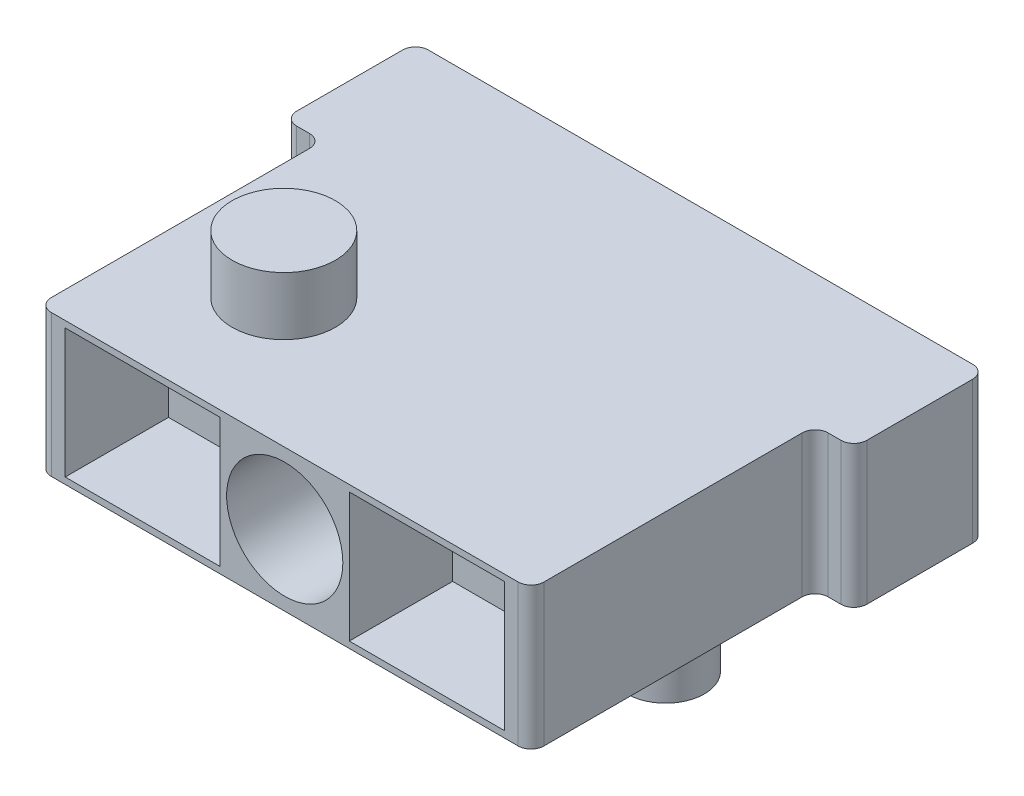
ISO-10303-21;
HEADER;
FILE_DESCRIPTION(('STEP AP214'),'2;1');
FILE_NAME('part.step','',(''),(''),'','','');
FILE_SCHEMA(('AUTOMOTIVE_DESIGN { 1 0 10303 214 1 1 1 1 }'));
ENDSEC;
DATA;
#1=APPLICATION_CONTEXT('core data for automotive mechanical design processes');
#2=APPLICATION_PROTOCOL_DEFINITION('international standard','automotive_design',2000,#1);
#3=PRODUCT_CONTEXT('',#1,'mechanical');
#4=PRODUCT('Part','Part','',(#3));
#5=PRODUCT_RELATED_PRODUCT_CATEGORY('part','',(#4));
#6=PRODUCT_DEFINITION_FORMATION('','',#4);
#7=PRODUCT_DEFINITION_CONTEXT('part definition',#1,'design');
#8=PRODUCT_DEFINITION('design','',#6,#7);
#9=PRODUCT_DEFINITION_SHAPE('','',#8);
#10=(LENGTH_UNIT() NAMED_UNIT(*) SI_UNIT(.MILLI.,.METRE.));
#11=(NAMED_UNIT(*) PLANE_ANGLE_UNIT() SI_UNIT($,.RADIAN.));
#12=(NAMED_UNIT(*) SI_UNIT($,.STERADIAN.) SOLID_ANGLE_UNIT());
#13=UNCERTAINTY_MEASURE_WITH_UNIT(LENGTH_MEASURE(1.E-05),#10,'distance_accuracy_value','');
#14=(GEOMETRIC_REPRESENTATION_CONTEXT(3) GLOBAL_UNCERTAINTY_ASSIGNED_CONTEXT((#13)) GLOBAL_UNIT_ASSIGNED_CONTEXT((#10,
#11,#12)) REPRESENTATION_CONTEXT('',''));
#15=CARTESIAN_POINT('',(0.,0.,0.));
#16=DIRECTION('',(0.,0.,1.));
#17=DIRECTION('',(1.,0.,0.));
#18=AXIS2_PLACEMENT_3D('',#15,#16,#17);
#19=CARTESIAN_POINT('',(22.075,-5.5,-32.2));
#20=DIRECTION('',(1.,0.,0.));
#21=DIRECTION('',(0.,0.,-1.));
#22=AXIS2_PLACEMENT_3D('',#19,#20,#21);
#23=PLANE('',#22);
#24=DIRECTION('',(0.,0.,1.));
#25=VECTOR('',#24,1.);
#26=CARTESIAN_POINT('',(22.075,-5.5,-32.2));
#27=LINE('',#26,#25);
#28=CARTESIAN_POINT('',(22.075,-5.5,-31.2));
#29=VERTEX_POINT('',#28);
#30=CARTESIAN_POINT('',(22.075,-5.5,-23.));
#31=VERTEX_POINT('',#30);
#32=EDGE_CURVE('E345',#29,#31,#27,.T.);
#33=ORIENTED_EDGE('',*,*,#32,.F.);
#34=DIRECTION('',(0.,1.,0.));
#35=VECTOR('',#34,1.);
#36=CARTESIAN_POINT('',(22.075,-5.5,-31.2));
#37=LINE('',#36,#35);
#38=CARTESIAN_POINT('',(22.075,5.5,-31.2));
#39=VERTEX_POINT('',#38);
#40=EDGE_CURVE('E405',#29,#39,#37,.T.);
#41=ORIENTED_EDGE('',*,*,#40,.T.);
#42=DIRECTION('',(0.,0.,1.));
#43=VECTOR('',#42,1.);
#44=CARTESIAN_POINT('',(22.075,5.5,-32.2));
#45=LINE('',#44,#43);
#46=CARTESIAN_POINT('',(22.075,5.5,-23.));
#47=VERTEX_POINT('',#46);
#48=EDGE_CURVE('E340',#39,#47,#45,.T.);
#49=ORIENTED_EDGE('',*,*,#48,.T.);
#50=DIRECTION('',(0.,1.,0.));
#51=VECTOR('',#50,1.);
#52=CARTESIAN_POINT('',(22.075,-5.5,-23.));
#53=LINE('',#52,#51);
#54=EDGE_CURVE('E403',#47,#31,#53,.F.);
#55=ORIENTED_EDGE('',*,*,#54,.T.);
#56=EDGE_LOOP('',(#33,#41,#49,#55));
#57=FACE_BOUND('',#56,.T.);
#58=ADVANCED_FACE('F35',(#57),#23,.T.);
#59=CARTESIAN_POINT('',(-22.075,-5.5,-32.2));
#60=DIRECTION('',(0.,-1.,0.));
#61=DIRECTION('',(0.,0.,-1.));
#62=AXIS2_PLACEMENT_3D('',#59,#60,#61);
#63=PLANE('',#62);
#64=DIRECTION('',(0.,0.,-1.));
#65=VECTOR('',#64,1.);
#66=CARTESIAN_POINT('',(19.075,-5.5,-32.2));
#67=LINE('',#66,#65);
#68=CARTESIAN_POINT('',(19.075,-5.5,-1.));
#69=VERTEX_POINT('',#68);
#70=CARTESIAN_POINT('',(19.075,-5.5,-21.));
#71=VERTEX_POINT('',#70);
#72=EDGE_CURVE('E287',#69,#71,#67,.T.);
#73=ORIENTED_EDGE('',*,*,#72,.F.);
#74=CARTESIAN_POINT('',(18.075,-5.5,-1.));
#75=DIRECTION('',(0.,-1.,0.));
#76=DIRECTION('',(0.,0.,-1.));
#77=AXIS2_PLACEMENT_3D('',#74,#75,#76);
#78=CIRCLE('',#77,1.);
#79=CARTESIAN_POINT('',(18.075,-5.5,0.));
#80=VERTEX_POINT('',#79);
#81=EDGE_CURVE('E388',#69,#80,#78,.T.);
#82=ORIENTED_EDGE('',*,*,#81,.T.);
#83=DIRECTION('',(1.,0.,0.));
#84=VECTOR('',#83,1.);
#85=CARTESIAN_POINT('',(-22.075,-5.5,0.));
#86=LINE('',#85,#84);
#87=CARTESIAN_POINT('',(-18.075,-5.5,0.));
#88=VERTEX_POINT('',#87);
#89=EDGE_CURVE('E337',#88,#80,#86,.T.);
#90=ORIENTED_EDGE('',*,*,#89,.F.);
#91=CARTESIAN_POINT('',(-18.075,-5.5,-1.));
#92=DIRECTION('',(0.,-1.,0.));
#93=DIRECTION('',(0.,0.,-1.));
#94=AXIS2_PLACEMENT_3D('',#91,#92,#93);
#95=CIRCLE('',#94,1.);
#96=CARTESIAN_POINT('',(-19.075,-5.5,-1.));
#97=VERTEX_POINT('',#96);
#98=EDGE_CURVE('E50',#88,#97,#95,.T.);
#99=ORIENTED_EDGE('',*,*,#98,.T.);
#100=DIRECTION('',(0.,0.,1.));
#101=VECTOR('',#100,1.);
#102=CARTESIAN_POINT('',(-19.075,-5.5,-32.2));
#103=LINE('',#102,#101);
#104=CARTESIAN_POINT('',(-19.075,-5.5,-21.));
#105=VERTEX_POINT('',#104);
#106=EDGE_CURVE('E294',#105,#97,#103,.T.);
#107=ORIENTED_EDGE('',*,*,#106,.F.);
#108=CARTESIAN_POINT('',(-20.075,-5.5,-21.));
#109=DIRECTION('',(0.,-1.,0.));
#110=DIRECTION('',(0.,0.,-1.));
#111=AXIS2_PLACEMENT_3D('',#108,#109,#110);
#112=CIRCLE('',#111,1.);
#113=CARTESIAN_POINT('',(-20.075,-5.5,-22.));
#114=VERTEX_POINT('',#113);
#115=EDGE_CURVE('E420',#105,#114,#112,.F.);
#116=ORIENTED_EDGE('',*,*,#115,.T.);
#117=DIRECTION('',(1.,0.,0.));
#118=VECTOR('',#117,1.);
#119=CARTESIAN_POINT('',(-22.075,-5.5,-22.));
#120=LINE('',#119,#118);
#121=CARTESIAN_POINT('',(-21.075,-5.5,-22.));
#122=VERTEX_POINT('',#121);
#123=EDGE_CURVE('E299',#122,#114,#120,.T.);
#124=ORIENTED_EDGE('',*,*,#123,.F.);
#125=CARTESIAN_POINT('',(-21.075,-5.5,-23.));
#126=DIRECTION('',(0.,-1.,0.));
#127=DIRECTION('',(0.,0.,-1.));
#128=AXIS2_PLACEMENT_3D('',#125,#126,#127);
#129=CIRCLE('',#128,1.);
#130=CARTESIAN_POINT('',(-22.075,-5.5,-23.));
#131=VERTEX_POINT('',#130);
#132=EDGE_CURVE('E381',#122,#131,#129,.T.);
#133=ORIENTED_EDGE('',*,*,#132,.T.);
#134=DIRECTION('',(0.,0.,1.));
#135=VECTOR('',#134,1.);
#136=CARTESIAN_POINT('',(-22.075,-5.5,-32.2));
#137=LINE('',#136,#135);
#138=CARTESIAN_POINT('',(-22.075,-5.5,-31.2));
#139=VERTEX_POINT('',#138);
#140=EDGE_CURVE('E349',#139,#131,#137,.T.);
#141=ORIENTED_EDGE('',*,*,#140,.F.);
#142=CARTESIAN_POINT('',(-21.075,-5.5,-31.2));
#143=DIRECTION('',(0.,-1.,0.));
#144=DIRECTION('',(0.,0.,-1.));
#145=AXIS2_PLACEMENT_3D('',#142,#143,#144);
#146=CIRCLE('',#145,1.);
#147=CARTESIAN_POINT('',(-21.075,-5.5,-32.2));
#148=VERTEX_POINT('',#147);
#149=EDGE_CURVE('E383',#139,#148,#146,.T.);
#150=ORIENTED_EDGE('',*,*,#149,.T.);
#151=DIRECTION('',(1.,0.,0.));
#152=VECTOR('',#151,1.);
#153=CARTESIAN_POINT('',(-22.075,-5.5,-32.2));
#154=LINE('',#153,#152);
#155=CARTESIAN_POINT('',(21.075,-5.5,-32.2));
#156=VERTEX_POINT('',#155);
#157=EDGE_CURVE('E336',#148,#156,#154,.T.);
#158=ORIENTED_EDGE('',*,*,#157,.T.);
#159=CARTESIAN_POINT('',(21.075,-5.5,-31.2));
#160=DIRECTION('',(0.,-1.,0.));
#161=DIRECTION('',(0.,0.,-1.));
#162=AXIS2_PLACEMENT_3D('',#159,#160,#161);
#163=CIRCLE('',#162,1.);
#164=EDGE_CURVE('E385',#156,#29,#163,.T.);
#165=ORIENTED_EDGE('',*,*,#164,.T.);
#166=ORIENTED_EDGE('',*,*,#32,.T.);
#167=CARTESIAN_POINT('',(21.075,-5.5,-23.));
#168=DIRECTION('',(0.,-1.,0.));
#169=DIRECTION('',(0.,0.,-1.));
#170=AXIS2_PLACEMENT_3D('',#167,#168,#169);
#171=CIRCLE('',#170,1.);
#172=CARTESIAN_POINT('',(21.075,-5.5,-22.));
#173=VERTEX_POINT('',#172);
#174=EDGE_CURVE('E379',#31,#173,#171,.T.);
#175=ORIENTED_EDGE('',*,*,#174,.T.);
#176=DIRECTION('',(1.,0.,0.));
#177=VECTOR('',#176,1.);
#178=CARTESIAN_POINT('',(-22.075,-5.5,-22.));
#179=LINE('',#178,#177);
#180=CARTESIAN_POINT('',(20.075,-5.5,-22.));
#181=VERTEX_POINT('',#180);
#182=EDGE_CURVE('E296',#181,#173,#179,.T.);
#183=ORIENTED_EDGE('',*,*,#182,.F.);
#184=CARTESIAN_POINT('',(20.075,-5.5,-21.));
#185=DIRECTION('',(0.,-1.,0.));
#186=DIRECTION('',(0.,0.,-1.));
#187=AXIS2_PLACEMENT_3D('',#184,#185,#186);
#188=CIRCLE('',#187,1.);
#189=EDGE_CURVE('E11',#181,#71,#188,.F.);
#190=ORIENTED_EDGE('',*,*,#189,.T.);
#191=EDGE_LOOP('',(#73,#82,#90,#99,#107,#116,#124,#133,#141,#150,#158,#165,#166,#175,#183,#190));
#192=FACE_BOUND('',#191,.T.);
#193=CARTESIAN_POINT('',(14.3,-5.5,-15.2));
#194=DIRECTION('',(0.,-1.,0.));
#195=DIRECTION('',(0.,0.,-1.));
#196=AXIS2_PLACEMENT_3D('',#193,#194,#195);
#197=CIRCLE('',#196,3.);
#198=CARTESIAN_POINT('',(14.3,-5.5,-18.2));
#199=VERTEX_POINT('',#198);
#200=EDGE_CURVE('E320',#199,#199,#197,.T.);
#201=ORIENTED_EDGE('',*,*,#200,.F.);
#202=EDGE_LOOP('',(#201));
#203=FACE_BOUND('',#202,.T.);
#204=CARTESIAN_POINT('',(-14.3,-5.5,-15.2));
#205=DIRECTION('',(0.,-1.,0.));
#206=DIRECTION('',(0.,0.,-1.));
#207=AXIS2_PLACEMENT_3D('',#204,#205,#206);
#208=CIRCLE('',#207,3.);
#209=CARTESIAN_POINT('',(-14.3,-5.5,-18.2));
#210=VERTEX_POINT('',#209);
#211=EDGE_CURVE('E324',#210,#210,#208,.T.);
#212=ORIENTED_EDGE('',*,*,#211,.F.);
#213=EDGE_LOOP('',(#212));
#214=FACE_BOUND('',#213,.T.);
#215=ADVANCED_FACE('F437',(#192,#203,#214),#63,.T.);
#216=CARTESIAN_POINT('',(-22.075,-5.5,-32.2));
#217=DIRECTION('',(-1.,0.,0.));
#218=DIRECTION('',(0.,0.,1.));
#219=AXIS2_PLACEMENT_3D('',#216,#217,#218);
#220=PLANE('',#219);
#221=DIRECTION('',(0.,0.,1.));
#222=VECTOR('',#221,1.);
#223=CARTESIAN_POINT('',(-22.075,5.5,-32.2));
#224=LINE('',#223,#222);
#225=CARTESIAN_POINT('',(-22.075,5.5,-31.2));
#226=VERTEX_POINT('',#225);
#227=CARTESIAN_POINT('',(-22.075,5.5,-23.));
#228=VERTEX_POINT('',#227);
#229=EDGE_CURVE('E352',#226,#228,#224,.T.);
#230=ORIENTED_EDGE('',*,*,#229,.F.);
#231=DIRECTION('',(0.,-1.,0.));
#232=VECTOR('',#231,1.);
#233=CARTESIAN_POINT('',(-22.075,-5.5,-31.2));
#234=LINE('',#233,#232);
#235=EDGE_CURVE('E415',#226,#139,#234,.T.);
#236=ORIENTED_EDGE('',*,*,#235,.T.);
#237=ORIENTED_EDGE('',*,*,#140,.T.);
#238=DIRECTION('',(0.,1.,0.));
#239=VECTOR('',#238,1.);
#240=CARTESIAN_POINT('',(-22.075,5.5,-23.));
#241=LINE('',#240,#239);
#242=EDGE_CURVE('E412',#131,#228,#241,.T.);
#243=ORIENTED_EDGE('',*,*,#242,.T.);
#244=EDGE_LOOP('',(#230,#236,#237,#243));
#245=FACE_BOUND('',#244,.T.);
#246=ADVANCED_FACE('F471',(#245),#220,.T.);
#247=CARTESIAN_POINT('',(-22.075,5.5,-32.2));
#248=DIRECTION('',(0.,1.,0.));
#249=DIRECTION('',(0.,0.,1.));
#250=AXIS2_PLACEMENT_3D('',#247,#248,#249);
#251=PLANE('',#250);
#252=DIRECTION('',(-1.,0.,0.));
#253=VECTOR('',#252,1.);
#254=CARTESIAN_POINT('',(-22.075,5.5,0.));
#255=LINE('',#254,#253);
#256=CARTESIAN_POINT('',(18.075,5.5,0.));
#257=VERTEX_POINT('',#256);
#258=CARTESIAN_POINT('',(-18.075,5.5,0.));
#259=VERTEX_POINT('',#258);
#260=EDGE_CURVE('E330',#257,#259,#255,.T.);
#261=ORIENTED_EDGE('',*,*,#260,.F.);
#262=CARTESIAN_POINT('',(18.075,5.5,-1.));
#263=DIRECTION('',(0.,1.,0.));
#264=DIRECTION('',(0.,0.,1.));
#265=AXIS2_PLACEMENT_3D('',#262,#263,#264);
#266=CIRCLE('',#265,1.);
#267=CARTESIAN_POINT('',(19.075,5.5,-1.));
#268=VERTEX_POINT('',#267);
#269=EDGE_CURVE('E372',#257,#268,#266,.T.);
#270=ORIENTED_EDGE('',*,*,#269,.T.);
#271=DIRECTION('',(0.,0.,1.));
#272=VECTOR('',#271,1.);
#273=CARTESIAN_POINT('',(19.075,5.5,0.));
#274=LINE('',#273,#272);
#275=CARTESIAN_POINT('',(19.075,5.5,-21.));
#276=VERTEX_POINT('',#275);
#277=EDGE_CURVE('E284',#276,#268,#274,.T.);
#278=ORIENTED_EDGE('',*,*,#277,.F.);
#279=CARTESIAN_POINT('',(20.075,5.5,-21.));
#280=DIRECTION('',(0.,1.,0.));
#281=DIRECTION('',(0.,0.,1.));
#282=AXIS2_PLACEMENT_3D('',#279,#280,#281);
#283=CIRCLE('',#282,1.);
#284=CARTESIAN_POINT('',(20.075,5.5,-22.));
#285=VERTEX_POINT('',#284);
#286=EDGE_CURVE('E43',#276,#285,#283,.F.);
#287=ORIENTED_EDGE('',*,*,#286,.T.);
#288=DIRECTION('',(-1.,0.,0.));
#289=VECTOR('',#288,1.);
#290=CARTESIAN_POINT('',(22.075,5.5,-22.));
#291=LINE('',#290,#289);
#292=CARTESIAN_POINT('',(21.075,5.5,-22.));
#293=VERTEX_POINT('',#292);
#294=EDGE_CURVE('E245',#293,#285,#291,.T.);
#295=ORIENTED_EDGE('',*,*,#294,.F.);
#296=CARTESIAN_POINT('',(21.075,5.5,-23.));
#297=DIRECTION('',(0.,1.,0.));
#298=DIRECTION('',(0.,0.,1.));
#299=AXIS2_PLACEMENT_3D('',#296,#297,#298);
#300=CIRCLE('',#299,1.);
#301=EDGE_CURVE('E362',#293,#47,#300,.T.);
#302=ORIENTED_EDGE('',*,*,#301,.T.);
#303=ORIENTED_EDGE('',*,*,#48,.F.);
#304=CARTESIAN_POINT('',(21.075,5.5,-31.2));
#305=DIRECTION('',(0.,1.,0.));
#306=DIRECTION('',(0.,0.,1.));
#307=AXIS2_PLACEMENT_3D('',#304,#305,#306);
#308=CIRCLE('',#307,1.);
#309=CARTESIAN_POINT('',(21.075,5.5,-32.2));
#310=VERTEX_POINT('',#309);
#311=EDGE_CURVE('E368',#39,#310,#308,.T.);
#312=ORIENTED_EDGE('',*,*,#311,.T.);
#313=DIRECTION('',(-1.,0.,0.));
#314=VECTOR('',#313,1.);
#315=CARTESIAN_POINT('',(-22.075,5.5,-32.2));
#316=LINE('',#315,#314);
#317=CARTESIAN_POINT('',(-21.075,5.5,-32.2));
#318=VERTEX_POINT('',#317);
#319=EDGE_CURVE('E333',#310,#318,#316,.T.);
#320=ORIENTED_EDGE('',*,*,#319,.T.);
#321=CARTESIAN_POINT('',(-21.075,5.5,-31.2));
#322=DIRECTION('',(0.,1.,0.));
#323=DIRECTION('',(0.,0.,1.));
#324=AXIS2_PLACEMENT_3D('',#321,#322,#323);
#325=CIRCLE('',#324,1.);
#326=EDGE_CURVE('E366',#318,#226,#325,.T.);
#327=ORIENTED_EDGE('',*,*,#326,.T.);
#328=ORIENTED_EDGE('',*,*,#229,.T.);
#329=CARTESIAN_POINT('',(-21.075,5.5,-23.));
#330=DIRECTION('',(0.,1.,0.));
#331=DIRECTION('',(0.,0.,1.));
#332=AXIS2_PLACEMENT_3D('',#329,#330,#331);
#333=CIRCLE('',#332,1.);
#334=CARTESIAN_POINT('',(-21.075,5.5,-22.));
#335=VERTEX_POINT('',#334);
#336=EDGE_CURVE('E364',#228,#335,#333,.T.);
#337=ORIENTED_EDGE('',*,*,#336,.T.);
#338=DIRECTION('',(-1.,0.,0.));
#339=VECTOR('',#338,1.);
#340=CARTESIAN_POINT('',(-22.075,5.5,-22.));
#341=LINE('',#340,#339);
#342=CARTESIAN_POINT('',(-20.075,5.5,-22.));
#343=VERTEX_POINT('',#342);
#344=EDGE_CURVE('E283',#343,#335,#341,.T.);
#345=ORIENTED_EDGE('',*,*,#344,.F.);
#346=CARTESIAN_POINT('',(-20.075,5.5,-21.));
#347=DIRECTION('',(0.,1.,0.));
#348=DIRECTION('',(0.,0.,1.));
#349=AXIS2_PLACEMENT_3D('',#346,#347,#348);
#350=CIRCLE('',#349,1.);
#351=CARTESIAN_POINT('',(-19.075,5.5,-21.));
#352=VERTEX_POINT('',#351);
#353=EDGE_CURVE('E418',#343,#352,#350,.F.);
#354=ORIENTED_EDGE('',*,*,#353,.T.);
#355=DIRECTION('',(0.,0.,-1.));
#356=VECTOR('',#355,1.);
#357=CARTESIAN_POINT('',(-19.075,5.5,0.));
#358=LINE('',#357,#356);
#359=CARTESIAN_POINT('',(-19.075,5.5,-1.));
#360=VERTEX_POINT('',#359);
#361=EDGE_CURVE('E281',#360,#352,#358,.T.);
#362=ORIENTED_EDGE('',*,*,#361,.F.);
#363=CARTESIAN_POINT('',(-18.075,5.5,-1.));
#364=DIRECTION('',(0.,1.,0.));
#365=DIRECTION('',(0.,0.,1.));
#366=AXIS2_PLACEMENT_3D('',#363,#364,#365);
#367=CIRCLE('',#366,1.);
#368=EDGE_CURVE('E370',#360,#259,#367,.T.);
#369=ORIENTED_EDGE('',*,*,#368,.T.);
#370=EDGE_LOOP('',(#261,#270,#278,#287,#295,#302,#303,#312,#320,#327,#328,#337,#345,#354,#362,#369));
#371=FACE_BOUND('',#370,.T.);
#372=CARTESIAN_POINT('',(-10.075,5.5,-10.));
#373=DIRECTION('',(0.,1.,0.));
#374=DIRECTION('',(0.,0.,1.));
#375=AXIS2_PLACEMENT_3D('',#372,#373,#374);
#376=CIRCLE('',#375,4.);
#377=CARTESIAN_POINT('',(-10.075,5.5,-6.));
#378=VERTEX_POINT('',#377);
#379=EDGE_CURVE('E302',#378,#378,#376,.T.);
#380=ORIENTED_EDGE('',*,*,#379,.F.);
#381=EDGE_LOOP('',(#380));
#382=FACE_BOUND('',#381,.T.);
#383=ADVANCED_FACE('F425',(#371,#382),#251,.T.);
#384=CARTESIAN_POINT('',(0.,0.,-32.2));
#385=DIRECTION('',(0.,0.,-1.));
#386=DIRECTION('',(-1.,0.,0.));
#387=AXIS2_PLACEMENT_3D('',#384,#385,#386);
#388=PLANE('',#387);
#389=ORIENTED_EDGE('',*,*,#319,.F.);
#390=DIRECTION('',(0.,1.,0.));
#391=VECTOR('',#390,1.);
#392=CARTESIAN_POINT('',(21.075,0.,-32.2));
#393=LINE('',#392,#391);
#394=EDGE_CURVE('E410',#310,#156,#393,.F.);
#395=ORIENTED_EDGE('',*,*,#394,.T.);
#396=ORIENTED_EDGE('',*,*,#157,.F.);
#397=DIRECTION('',(0.,-1.,0.));
#398=VECTOR('',#397,1.);
#399=CARTESIAN_POINT('',(-21.075,0.,-32.2));
#400=LINE('',#399,#398);
#401=EDGE_CURVE('E408',#148,#318,#400,.F.);
#402=ORIENTED_EDGE('',*,*,#401,.T.);
#403=EDGE_LOOP('',(#389,#395,#396,#402));
#404=FACE_BOUND('',#403,.T.);
#405=ADVANCED_FACE('F481',(#404),#388,.T.);
#406=CARTESIAN_POINT('',(0.,0.,0.));
#407=DIRECTION('',(0.,0.,-1.));
#408=DIRECTION('',(-1.,0.,0.));
#409=AXIS2_PLACEMENT_3D('',#406,#407,#408);
#410=PLANE('',#409);
#411=CARTESIAN_POINT('',(0.,0.,0.));
#412=DIRECTION('',(0.,0.,1.));
#413=DIRECTION('',(1.,0.,0.));
#414=AXIS2_PLACEMENT_3D('',#411,#412,#413);
#415=CIRCLE('',#414,4.5);
#416=CARTESIAN_POINT('',(4.5,0.,0.));
#417=VERTEX_POINT('',#416);
#418=EDGE_CURVE('E232',#417,#417,#415,.T.);
#419=ORIENTED_EDGE('',*,*,#418,.F.);
#420=EDGE_LOOP('',(#419));
#421=FACE_BOUND('',#420,.T.);
#422=DIRECTION('',(1.,0.,0.));
#423=VECTOR('',#422,1.);
#424=CARTESIAN_POINT('',(-17.,-5.,0.));
#425=LINE('',#424,#423);
#426=CARTESIAN_POINT('',(-17.,-5.,0.));
#427=VERTEX_POINT('',#426);
#428=CARTESIAN_POINT('',(-5.,-5.,0.));
#429=VERTEX_POINT('',#428);
#430=EDGE_CURVE('E238',#427,#429,#425,.T.);
#431=ORIENTED_EDGE('',*,*,#430,.F.);
#432=DIRECTION('',(0.,-1.,0.));
#433=VECTOR('',#432,1.);
#434=CARTESIAN_POINT('',(-17.,5.,0.));
#435=LINE('',#434,#433);
#436=CARTESIAN_POINT('',(-17.,5.,0.));
#437=VERTEX_POINT('',#436);
#438=EDGE_CURVE('E209',#437,#427,#435,.T.);
#439=ORIENTED_EDGE('',*,*,#438,.F.);
#440=DIRECTION('',(-1.,0.,0.));
#441=VECTOR('',#440,1.);
#442=CARTESIAN_POINT('',(-17.,5.,0.));
#443=LINE('',#442,#441);
#444=CARTESIAN_POINT('',(-5.,5.,0.));
#445=VERTEX_POINT('',#444);
#446=EDGE_CURVE('E226',#445,#437,#443,.T.);
#447=ORIENTED_EDGE('',*,*,#446,.F.);
#448=DIRECTION('',(0.,1.,0.));
#449=VECTOR('',#448,1.);
#450=CARTESIAN_POINT('',(-5.,5.,0.));
#451=LINE('',#450,#449);
#452=EDGE_CURVE('E229',#429,#445,#451,.T.);
#453=ORIENTED_EDGE('',*,*,#452,.F.);
#454=EDGE_LOOP('',(#431,#439,#447,#453));
#455=FACE_BOUND('',#454,.T.);
#456=DIRECTION('',(1.,0.,0.));
#457=VECTOR('',#456,1.);
#458=CARTESIAN_POINT('',(5.,-5.,0.));
#459=LINE('',#458,#457);
#460=CARTESIAN_POINT('',(5.,-5.,0.));
#461=VERTEX_POINT('',#460);
#462=CARTESIAN_POINT('',(17.,-5.,0.));
#463=VERTEX_POINT('',#462);
#464=EDGE_CURVE('E265',#461,#463,#459,.T.);
#465=ORIENTED_EDGE('',*,*,#464,.F.);
#466=DIRECTION('',(0.,-1.,0.));
#467=VECTOR('',#466,1.);
#468=CARTESIAN_POINT('',(5.,5.,0.));
#469=LINE('',#468,#467);
#470=CARTESIAN_POINT('',(5.,5.,0.));
#471=VERTEX_POINT('',#470);
#472=EDGE_CURVE('E263',#471,#461,#469,.T.);
#473=ORIENTED_EDGE('',*,*,#472,.F.);
#474=DIRECTION('',(-1.,0.,0.));
#475=VECTOR('',#474,1.);
#476=CARTESIAN_POINT('',(5.,5.,0.));
#477=LINE('',#476,#475);
#478=CARTESIAN_POINT('',(17.,5.,0.));
#479=VERTEX_POINT('',#478);
#480=EDGE_CURVE('E253',#479,#471,#477,.T.);
#481=ORIENTED_EDGE('',*,*,#480,.F.);
#482=DIRECTION('',(0.,1.,0.));
#483=VECTOR('',#482,1.);
#484=CARTESIAN_POINT('',(17.,5.,0.));
#485=LINE('',#484,#483);
#486=EDGE_CURVE('E269',#463,#479,#485,.T.);
#487=ORIENTED_EDGE('',*,*,#486,.F.);
#488=EDGE_LOOP('',(#465,#473,#481,#487));
#489=FACE_BOUND('',#488,.T.);
#490=ORIENTED_EDGE('',*,*,#89,.T.);
#491=DIRECTION('',(0.,1.,0.));
#492=VECTOR('',#491,1.);
#493=CARTESIAN_POINT('',(18.075,0.,0.));
#494=LINE('',#493,#492);
#495=EDGE_CURVE('E359',#80,#257,#494,.T.);
#496=ORIENTED_EDGE('',*,*,#495,.T.);
#497=ORIENTED_EDGE('',*,*,#260,.T.);
#498=DIRECTION('',(0.,-1.,0.));
#499=VECTOR('',#498,1.);
#500=CARTESIAN_POINT('',(-18.075,0.,0.));
#501=LINE('',#500,#499);
#502=EDGE_CURVE('E348',#259,#88,#501,.T.);
#503=ORIENTED_EDGE('',*,*,#502,.T.);
#504=EDGE_LOOP('',(#490,#496,#497,#503));
#505=FACE_BOUND('',#504,.T.);
#506=ADVANCED_FACE('F447',(#421,#455,#489,#505),#410,.F.);
#507=CARTESIAN_POINT('',(-14.3,-10.,-15.2));
#508=DIRECTION('',(0.,1.,0.));
#509=DIRECTION('',(0.,0.,1.));
#510=AXIS2_PLACEMENT_3D('',#507,#508,#509);
#511=CYLINDRICAL_SURFACE('',#510,3.);
#512=CARTESIAN_POINT('',(-14.3,-10.,-15.2));
#513=DIRECTION('',(0.,-1.,0.));
#514=DIRECTION('',(0.,0.,-1.));
#515=AXIS2_PLACEMENT_3D('',#512,#513,#514);
#516=CIRCLE('',#515,3.);
#517=CARTESIAN_POINT('',(-14.3,-10.,-18.2));
#518=VERTEX_POINT('',#517);
#519=EDGE_CURVE('E327',#518,#518,#516,.T.);
#520=ORIENTED_EDGE('',*,*,#519,.F.);
#521=EDGE_LOOP('',(#520));
#522=FACE_BOUND('',#521,.T.);
#523=ORIENTED_EDGE('',*,*,#211,.T.);
#524=EDGE_LOOP('',(#523));
#525=FACE_BOUND('',#524,.T.);
#526=ADVANCED_FACE('F770',(#522,#525),#511,.T.);
#527=CARTESIAN_POINT('',(-14.3,-10.,-15.2));
#528=DIRECTION('',(0.,-1.,0.));
#529=DIRECTION('',(0.,0.,-1.));
#530=AXIS2_PLACEMENT_3D('',#527,#528,#529);
#531=PLANE('',#530);
#532=CARTESIAN_POINT('',(-14.3,-10.,-15.2));
#533=DIRECTION('',(0.,-1.,0.));
#534=DIRECTION('',(0.,0.,-1.));
#535=AXIS2_PLACEMENT_3D('',#532,#533,#534);
#536=CIRCLE('',#535,1.24999999999999);
#537=CARTESIAN_POINT('',(-14.3,-10.,-16.45));
#538=VERTEX_POINT('',#537);
#539=EDGE_CURVE('E306',#538,#538,#536,.T.);
#540=ORIENTED_EDGE('',*,*,#539,.F.);
#541=EDGE_LOOP('',(#540));
#542=FACE_BOUND('',#541,.T.);
#543=ORIENTED_EDGE('',*,*,#519,.T.);
#544=EDGE_LOOP('',(#543));
#545=FACE_BOUND('',#544,.T.);
#546=ADVANCED_FACE('F761',(#542,#545),#531,.T.);
#547=CARTESIAN_POINT('',(14.3,-10.,-15.2));
#548=DIRECTION('',(0.,1.,0.));
#549=DIRECTION('',(0.,0.,1.));
#550=AXIS2_PLACEMENT_3D('',#547,#548,#549);
#551=CYLINDRICAL_SURFACE('',#550,3.);
#552=CARTESIAN_POINT('',(14.3,-10.,-15.2));
#553=DIRECTION('',(0.,-1.,0.));
#554=DIRECTION('',(0.,0.,-1.));
#555=AXIS2_PLACEMENT_3D('',#552,#553,#554);
#556=CIRCLE('',#555,3.);
#557=CARTESIAN_POINT('',(14.3,-10.,-18.2));
#558=VERTEX_POINT('',#557);
#559=EDGE_CURVE('E321',#558,#558,#556,.T.);
#560=ORIENTED_EDGE('',*,*,#559,.F.);
#561=EDGE_LOOP('',(#560));
#562=FACE_BOUND('',#561,.T.);
#563=ORIENTED_EDGE('',*,*,#200,.T.);
#564=EDGE_LOOP('',(#563));
#565=FACE_BOUND('',#564,.T.);
#566=ADVANCED_FACE('F751',(#562,#565),#551,.T.);
#567=CARTESIAN_POINT('',(14.3,-10.,-15.2));
#568=DIRECTION('',(0.,-1.,0.));
#569=DIRECTION('',(0.,0.,-1.));
#570=AXIS2_PLACEMENT_3D('',#567,#568,#569);
#571=PLANE('',#570);
#572=CARTESIAN_POINT('',(14.3,-10.,-15.2));
#573=DIRECTION('',(0.,-1.,0.));
#574=DIRECTION('',(0.,0.,-1.));
#575=AXIS2_PLACEMENT_3D('',#572,#573,#574);
#576=CIRCLE('',#575,1.24999999999999);
#577=CARTESIAN_POINT('',(14.3,-10.,-16.45));
#578=VERTEX_POINT('',#577);
#579=EDGE_CURVE('E314',#578,#578,#576,.T.);
#580=ORIENTED_EDGE('',*,*,#579,.F.);
#581=EDGE_LOOP('',(#580));
#582=FACE_BOUND('',#581,.T.);
#583=ORIENTED_EDGE('',*,*,#559,.T.);
#584=EDGE_LOOP('',(#583));
#585=FACE_BOUND('',#584,.T.);
#586=ADVANCED_FACE('F742',(#582,#585),#571,.T.);
#587=CARTESIAN_POINT('',(14.3,-5.,-15.2));
#588=DIRECTION('',(0.,-1.,0.));
#589=DIRECTION('',(0.,0.,-1.));
#590=AXIS2_PLACEMENT_3D('',#587,#588,#589);
#591=CONICAL_SURFACE('',#590,1.25,1.02974425867665);
#592=CARTESIAN_POINT('',(14.3,-4.24892422621555,-15.2));
#593=VERTEX_POINT('',#592);
#594=VERTEX_LOOP('',#593);
#595=FACE_BOUND('',#594,.T.);
#596=CARTESIAN_POINT('',(14.3,-5.,-15.2));
#597=DIRECTION('',(0.,-1.,0.));
#598=DIRECTION('',(0.,0.,-1.));
#599=AXIS2_PLACEMENT_3D('',#596,#597,#598);
#600=CIRCLE('',#599,1.25);
#601=CARTESIAN_POINT('',(14.3,-5.,-16.45));
#602=VERTEX_POINT('',#601);
#603=EDGE_CURVE('E317',#602,#602,#600,.T.);
#604=ORIENTED_EDGE('',*,*,#603,.T.);
#605=EDGE_LOOP('',(#604));
#606=FACE_BOUND('',#605,.T.);
#607=ADVANCED_FACE('F733',(#595,#606),#591,.F.);
#608=CARTESIAN_POINT('',(14.3,-10.,-15.2));
#609=DIRECTION('',(0.,-1.,0.));
#610=DIRECTION('',(0.,0.,-1.));
#611=AXIS2_PLACEMENT_3D('',#608,#609,#610);
#612=CYLINDRICAL_SURFACE('',#611,1.24999999999999);
#613=ORIENTED_EDGE('',*,*,#603,.F.);
#614=EDGE_LOOP('',(#613));
#615=FACE_BOUND('',#614,.T.);
#616=ORIENTED_EDGE('',*,*,#579,.T.);
#617=EDGE_LOOP('',(#616));
#618=FACE_BOUND('',#617,.T.);
#619=ADVANCED_FACE('F724',(#615,#618),#612,.F.);
#620=CARTESIAN_POINT('',(-14.3,-5.,-15.2));
#621=DIRECTION('',(0.,-1.,0.));
#622=DIRECTION('',(0.,0.,-1.));
#623=AXIS2_PLACEMENT_3D('',#620,#621,#622);
#624=CONICAL_SURFACE('',#623,1.25,1.02974425867665);
#625=CARTESIAN_POINT('',(-14.3,-4.24892422621555,-15.2));
#626=VERTEX_POINT('',#625);
#627=VERTEX_LOOP('',#626);
#628=FACE_BOUND('',#627,.T.);
#629=CARTESIAN_POINT('',(-14.3,-5.,-15.2));
#630=DIRECTION('',(0.,-1.,0.));
#631=DIRECTION('',(0.,0.,-1.));
#632=AXIS2_PLACEMENT_3D('',#629,#630,#631);
#633=CIRCLE('',#632,1.25);
#634=CARTESIAN_POINT('',(-14.3,-5.,-16.45));
#635=VERTEX_POINT('',#634);
#636=EDGE_CURVE('E311',#635,#635,#633,.T.);
#637=ORIENTED_EDGE('',*,*,#636,.T.);
#638=EDGE_LOOP('',(#637));
#639=FACE_BOUND('',#638,.T.);
#640=ADVANCED_FACE('F715',(#628,#639),#624,.F.);
#641=CARTESIAN_POINT('',(-14.3,-10.,-15.2));
#642=DIRECTION('',(0.,-1.,0.));
#643=DIRECTION('',(0.,0.,-1.));
#644=AXIS2_PLACEMENT_3D('',#641,#642,#643);
#645=CYLINDRICAL_SURFACE('',#644,1.24999999999999);
#646=ORIENTED_EDGE('',*,*,#636,.F.);
#647=EDGE_LOOP('',(#646));
#648=FACE_BOUND('',#647,.T.);
#649=ORIENTED_EDGE('',*,*,#539,.T.);
#650=EDGE_LOOP('',(#649));
#651=FACE_BOUND('',#650,.T.);
#652=ADVANCED_FACE('F706',(#648,#651),#645,.F.);
#653=CARTESIAN_POINT('',(-10.075,10.,-10.));
#654=DIRECTION('',(0.,-1.,0.));
#655=DIRECTION('',(0.,0.,-1.));
#656=AXIS2_PLACEMENT_3D('',#653,#654,#655);
#657=CYLINDRICAL_SURFACE('',#656,4.);
#658=CARTESIAN_POINT('',(-10.075,10.,-10.));
#659=DIRECTION('',(0.,1.,0.));
#660=DIRECTION('',(0.,0.,1.));
#661=AXIS2_PLACEMENT_3D('',#658,#659,#660);
#662=CIRCLE('',#661,4.);
#663=CARTESIAN_POINT('',(-10.075,10.,-6.));
#664=VERTEX_POINT('',#663);
#665=EDGE_CURVE('E303',#664,#664,#662,.T.);
#666=ORIENTED_EDGE('',*,*,#665,.F.);
#667=EDGE_LOOP('',(#666));
#668=FACE_BOUND('',#667,.T.);
#669=ORIENTED_EDGE('',*,*,#379,.T.);
#670=EDGE_LOOP('',(#669));
#671=FACE_BOUND('',#670,.T.);
#672=ADVANCED_FACE('F697',(#668,#671),#657,.T.);
#673=CARTESIAN_POINT('',(-10.075,10.,-10.));
#674=DIRECTION('',(0.,1.,0.));
#675=DIRECTION('',(0.,0.,1.));
#676=AXIS2_PLACEMENT_3D('',#673,#674,#675);
#677=PLANE('',#676);
#678=ORIENTED_EDGE('',*,*,#665,.T.);
#679=EDGE_LOOP('',(#678));
#680=FACE_BOUND('',#679,.T.);
#681=ADVANCED_FACE('F689',(#680),#677,.T.);
#682=CARTESIAN_POINT('',(19.075,-10.,0.));
#683=DIRECTION('',(-1.,0.,0.));
#684=DIRECTION('',(0.,0.,1.));
#685=AXIS2_PLACEMENT_3D('',#682,#683,#684);
#686=PLANE('',#685);
#687=ORIENTED_EDGE('',*,*,#277,.T.);
#688=DIRECTION('',(0.,1.,0.));
#689=VECTOR('',#688,1.);
#690=CARTESIAN_POINT('',(19.075,-10.,-1.));
#691=LINE('',#690,#689);
#692=EDGE_CURVE('E377',#268,#69,#691,.F.);
#693=ORIENTED_EDGE('',*,*,#692,.T.);
#694=ORIENTED_EDGE('',*,*,#72,.T.);
#695=DIRECTION('',(0.,1.,0.));
#696=VECTOR('',#695,1.);
#697=CARTESIAN_POINT('',(19.075,5.5,-21.));
#698=LINE('',#697,#696);
#699=EDGE_CURVE('E374',#71,#276,#698,.T.);
#700=ORIENTED_EDGE('',*,*,#699,.T.);
#701=EDGE_LOOP('',(#687,#693,#694,#700));
#702=FACE_BOUND('',#701,.T.);
#703=ADVANCED_FACE('F441',(#702),#686,.F.);
#704=CARTESIAN_POINT('',(22.075,-10.,-22.));
#705=DIRECTION('',(0.,0.,-1.));
#706=DIRECTION('',(-1.,0.,0.));
#707=AXIS2_PLACEMENT_3D('',#704,#705,#706);
#708=PLANE('',#707);
#709=ORIENTED_EDGE('',*,*,#294,.T.);
#710=DIRECTION('',(0.,1.,0.));
#711=VECTOR('',#710,1.);
#712=CARTESIAN_POINT('',(20.075,-5.5,-22.));
#713=LINE('',#712,#711);
#714=EDGE_CURVE('E401',#285,#181,#713,.F.);
#715=ORIENTED_EDGE('',*,*,#714,.T.);
#716=ORIENTED_EDGE('',*,*,#182,.T.);
#717=DIRECTION('',(0.,1.,0.));
#718=VECTOR('',#717,1.);
#719=CARTESIAN_POINT('',(21.075,5.5,-22.));
#720=LINE('',#719,#718);
#721=EDGE_CURVE('E398',#173,#293,#720,.T.);
#722=ORIENTED_EDGE('',*,*,#721,.T.);
#723=EDGE_LOOP('',(#709,#715,#716,#722));
#724=FACE_BOUND('',#723,.T.);
#725=ADVANCED_FACE('F431',(#724),#708,.F.);
#726=CARTESIAN_POINT('',(-22.075,-10.,-22.));
#727=DIRECTION('',(0.,0.,-1.));
#728=DIRECTION('',(-1.,0.,0.));
#729=AXIS2_PLACEMENT_3D('',#726,#727,#728);
#730=PLANE('',#729);
#731=ORIENTED_EDGE('',*,*,#123,.T.);
#732=DIRECTION('',(0.,1.,0.));
#733=VECTOR('',#732,1.);
#734=CARTESIAN_POINT('',(-20.075,5.5,-22.));
#735=LINE('',#734,#733);
#736=EDGE_CURVE('E395',#114,#343,#735,.T.);
#737=ORIENTED_EDGE('',*,*,#736,.T.);
#738=ORIENTED_EDGE('',*,*,#344,.T.);
#739=DIRECTION('',(0.,1.,0.));
#740=VECTOR('',#739,1.);
#741=CARTESIAN_POINT('',(-21.075,-5.5,-22.));
#742=LINE('',#741,#740);
#743=EDGE_CURVE('E393',#335,#122,#742,.F.);
#744=ORIENTED_EDGE('',*,*,#743,.T.);
#745=EDGE_LOOP('',(#731,#737,#738,#744));
#746=FACE_BOUND('',#745,.T.);
#747=ADVANCED_FACE('F461',(#746),#730,.F.);
#748=CARTESIAN_POINT('',(-19.075,-10.,0.));
#749=DIRECTION('',(1.,0.,0.));
#750=DIRECTION('',(0.,0.,-1.));
#751=AXIS2_PLACEMENT_3D('',#748,#749,#750);
#752=PLANE('',#751);
#753=ORIENTED_EDGE('',*,*,#106,.T.);
#754=DIRECTION('',(0.,-1.,0.));
#755=VECTOR('',#754,1.);
#756=CARTESIAN_POINT('',(-19.075,-10.,-1.));
#757=LINE('',#756,#755);
#758=EDGE_CURVE('E391',#97,#360,#757,.F.);
#759=ORIENTED_EDGE('',*,*,#758,.T.);
#760=ORIENTED_EDGE('',*,*,#361,.T.);
#761=DIRECTION('',(0.,1.,0.));
#762=VECTOR('',#761,1.);
#763=CARTESIAN_POINT('',(-19.075,-5.5,-21.));
#764=LINE('',#763,#762);
#765=EDGE_CURVE('E57',#352,#105,#764,.F.);
#766=ORIENTED_EDGE('',*,*,#765,.T.);
#767=EDGE_LOOP('',(#753,#759,#760,#766));
#768=FACE_BOUND('',#767,.T.);
#769=ADVANCED_FACE('F454',(#768),#752,.F.);
#770=CARTESIAN_POINT('',(5.,5.,-8.));
#771=DIRECTION('',(-1.,0.,0.));
#772=DIRECTION('',(0.,-1.,0.));
#773=AXIS2_PLACEMENT_3D('',#770,#771,#772);
#774=PLANE('',#773);
#775=ORIENTED_EDGE('',*,*,#472,.T.);
#776=DIRECTION('',(0.,0.,1.));
#777=VECTOR('',#776,1.);
#778=CARTESIAN_POINT('',(5.,-5.,-8.));
#779=LINE('',#778,#777);
#780=CARTESIAN_POINT('',(5.,-5.,-8.));
#781=VERTEX_POINT('',#780);
#782=EDGE_CURVE('E262',#781,#461,#779,.T.);
#783=ORIENTED_EDGE('',*,*,#782,.F.);
#784=DIRECTION('',(0.,-1.,0.));
#785=VECTOR('',#784,1.);
#786=CARTESIAN_POINT('',(5.,5.,-8.));
#787=LINE('',#786,#785);
#788=CARTESIAN_POINT('',(5.,5.,-8.));
#789=VERTEX_POINT('',#788);
#790=EDGE_CURVE('E249',#789,#781,#787,.T.);
#791=ORIENTED_EDGE('',*,*,#790,.F.);
#792=DIRECTION('',(0.,0.,1.));
#793=VECTOR('',#792,1.);
#794=CARTESIAN_POINT('',(5.,5.,-8.));
#795=LINE('',#794,#793);
#796=EDGE_CURVE('E239',#789,#471,#795,.T.);
#797=ORIENTED_EDGE('',*,*,#796,.T.);
#798=EDGE_LOOP('',(#775,#783,#791,#797));
#799=FACE_BOUND('',#798,.T.);
#800=ADVANCED_FACE('F651',(#799),#774,.F.);
#801=CARTESIAN_POINT('',(5.,5.,-8.));
#802=DIRECTION('',(0.,1.,0.));
#803=DIRECTION('',(-1.,0.,0.));
#804=AXIS2_PLACEMENT_3D('',#801,#802,#803);
#805=PLANE('',#804);
#806=ORIENTED_EDGE('',*,*,#480,.T.);
#807=ORIENTED_EDGE('',*,*,#796,.F.);
#808=DIRECTION('',(-1.,0.,0.));
#809=VECTOR('',#808,1.);
#810=CARTESIAN_POINT('',(5.,5.,-8.));
#811=LINE('',#810,#809);
#812=CARTESIAN_POINT('',(17.,5.,-8.));
#813=VERTEX_POINT('',#812);
#814=EDGE_CURVE('E259',#813,#789,#811,.T.);
#815=ORIENTED_EDGE('',*,*,#814,.F.);
#816=DIRECTION('',(0.,0.,1.));
#817=VECTOR('',#816,1.);
#818=CARTESIAN_POINT('',(17.,5.,-8.));
#819=LINE('',#818,#817);
#820=EDGE_CURVE('E275',#813,#479,#819,.T.);
#821=ORIENTED_EDGE('',*,*,#820,.T.);
#822=EDGE_LOOP('',(#806,#807,#815,#821));
#823=FACE_BOUND('',#822,.T.);
#824=ADVANCED_FACE('F642',(#823),#805,.F.);
#825=CARTESIAN_POINT('',(17.,5.,-8.));
#826=DIRECTION('',(1.,0.,0.));
#827=DIRECTION('',(0.,0.,-1.));
#828=AXIS2_PLACEMENT_3D('',#825,#826,#827);
#829=PLANE('',#828);
#830=ORIENTED_EDGE('',*,*,#486,.T.);
#831=ORIENTED_EDGE('',*,*,#820,.F.);
#832=DIRECTION('',(0.,1.,0.));
#833=VECTOR('',#832,1.);
#834=CARTESIAN_POINT('',(17.,5.,-8.));
#835=LINE('',#834,#833);
#836=CARTESIAN_POINT('',(17.,-5.,-8.));
#837=VERTEX_POINT('',#836);
#838=EDGE_CURVE('E256',#837,#813,#835,.T.);
#839=ORIENTED_EDGE('',*,*,#838,.F.);
#840=DIRECTION('',(0.,0.,1.));
#841=VECTOR('',#840,1.);
#842=CARTESIAN_POINT('',(17.,-5.,-8.));
#843=LINE('',#842,#841);
#844=EDGE_CURVE('E277',#837,#463,#843,.T.);
#845=ORIENTED_EDGE('',*,*,#844,.T.);
#846=EDGE_LOOP('',(#830,#831,#839,#845));
#847=FACE_BOUND('',#846,.T.);
#848=ADVANCED_FACE('F633',(#847),#829,.F.);
#849=CARTESIAN_POINT('',(5.,-5.,-8.));
#850=DIRECTION('',(0.,-1.,0.));
#851=DIRECTION('',(1.,0.,0.));
#852=AXIS2_PLACEMENT_3D('',#849,#850,#851);
#853=PLANE('',#852);
#854=ORIENTED_EDGE('',*,*,#464,.T.);
#855=ORIENTED_EDGE('',*,*,#844,.F.);
#856=DIRECTION('',(1.,0.,0.));
#857=VECTOR('',#856,1.);
#858=CARTESIAN_POINT('',(5.,-5.,-8.));
#859=LINE('',#858,#857);
#860=EDGE_CURVE('E252',#781,#837,#859,.T.);
#861=ORIENTED_EDGE('',*,*,#860,.F.);
#862=ORIENTED_EDGE('',*,*,#782,.T.);
#863=EDGE_LOOP('',(#854,#855,#861,#862));
#864=FACE_BOUND('',#863,.T.);
#865=ADVANCED_FACE('F624',(#864),#853,.F.);
#866=CARTESIAN_POINT('',(0.,0.,-8.));
#867=DIRECTION('',(0.,0.,1.));
#868=DIRECTION('',(1.,0.,0.));
#869=AXIS2_PLACEMENT_3D('',#866,#867,#868);
#870=PLANE('',#869);
#871=ORIENTED_EDGE('',*,*,#790,.T.);
#872=ORIENTED_EDGE('',*,*,#860,.T.);
#873=ORIENTED_EDGE('',*,*,#838,.T.);
#874=ORIENTED_EDGE('',*,*,#814,.T.);
#875=EDGE_LOOP('',(#871,#872,#873,#874));
#876=FACE_BOUND('',#875,.T.);
#877=ADVANCED_FACE('F616',(#876),#870,.T.);
#878=CARTESIAN_POINT('',(-17.,5.,-8.));
#879=DIRECTION('',(-1.,0.,0.));
#880=DIRECTION('',(0.,0.,1.));
#881=AXIS2_PLACEMENT_3D('',#878,#879,#880);
#882=PLANE('',#881);
#883=ORIENTED_EDGE('',*,*,#438,.T.);
#884=DIRECTION('',(0.,0.,1.));
#885=VECTOR('',#884,1.);
#886=CARTESIAN_POINT('',(-17.,-5.,-8.));
#887=LINE('',#886,#885);
#888=CARTESIAN_POINT('',(-17.,-5.,-8.));
#889=VERTEX_POINT('',#888);
#890=EDGE_CURVE('E202',#889,#427,#887,.T.);
#891=ORIENTED_EDGE('',*,*,#890,.F.);
#892=DIRECTION('',(0.,-1.,0.));
#893=VECTOR('',#892,1.);
#894=CARTESIAN_POINT('',(-17.,5.,-8.));
#895=LINE('',#894,#893);
#896=CARTESIAN_POINT('',(-17.,5.,-8.));
#897=VERTEX_POINT('',#896);
#898=EDGE_CURVE('E206',#897,#889,#895,.T.);
#899=ORIENTED_EDGE('',*,*,#898,.F.);
#900=DIRECTION('',(0.,0.,1.));
#901=VECTOR('',#900,1.);
#902=CARTESIAN_POINT('',(-17.,5.,-8.));
#903=LINE('',#902,#901);
#904=EDGE_CURVE('E243',#897,#437,#903,.T.);
#905=ORIENTED_EDGE('',*,*,#904,.T.);
#906=EDGE_LOOP('',(#883,#891,#899,#905));
#907=FACE_BOUND('',#906,.T.);
#908=ADVANCED_FACE('F204',(#907),#882,.F.);
#909=CARTESIAN_POINT('',(-17.,5.,-8.));
#910=DIRECTION('',(0.,1.,0.));
#911=DIRECTION('',(0.,0.,1.));
#912=AXIS2_PLACEMENT_3D('',#909,#910,#911);
#913=PLANE('',#912);
#914=ORIENTED_EDGE('',*,*,#446,.T.);
#915=ORIENTED_EDGE('',*,*,#904,.F.);
#916=DIRECTION('',(-1.,0.,0.));
#917=VECTOR('',#916,1.);
#918=CARTESIAN_POINT('',(-17.,5.,-8.));
#919=LINE('',#918,#917);
#920=CARTESIAN_POINT('',(-5.,5.,-8.));
#921=VERTEX_POINT('',#920);
#922=EDGE_CURVE('E214',#921,#897,#919,.T.);
#923=ORIENTED_EDGE('',*,*,#922,.F.);
#924=DIRECTION('',(0.,0.,1.));
#925=VECTOR('',#924,1.);
#926=CARTESIAN_POINT('',(-5.,5.,-8.));
#927=LINE('',#926,#925);
#928=EDGE_CURVE('E246',#921,#445,#927,.T.);
#929=ORIENTED_EDGE('',*,*,#928,.T.);
#930=EDGE_LOOP('',(#914,#915,#923,#929));
#931=FACE_BOUND('',#930,.T.);
#932=ADVANCED_FACE('F599',(#931),#913,.F.);
#933=CARTESIAN_POINT('',(-5.,5.,-8.));
#934=DIRECTION('',(1.,0.,0.));
#935=DIRECTION('',(0.,0.,-1.));
#936=AXIS2_PLACEMENT_3D('',#933,#934,#935);
#937=PLANE('',#936);
#938=ORIENTED_EDGE('',*,*,#452,.T.);
#939=ORIENTED_EDGE('',*,*,#928,.F.);
#940=DIRECTION('',(0.,1.,0.));
#941=VECTOR('',#940,1.);
#942=CARTESIAN_POINT('',(-5.,5.,-8.));
#943=LINE('',#942,#941);
#944=CARTESIAN_POINT('',(-5.,-5.,-8.));
#945=VERTEX_POINT('',#944);
#946=EDGE_CURVE('E222',#945,#921,#943,.T.);
#947=ORIENTED_EDGE('',*,*,#946,.F.);
#948=DIRECTION('',(0.,0.,1.));
#949=VECTOR('',#948,1.);
#950=CARTESIAN_POINT('',(-5.,-5.,-8.));
#951=LINE('',#950,#949);
#952=EDGE_CURVE('E213',#945,#429,#951,.T.);
#953=ORIENTED_EDGE('',*,*,#952,.T.);
#954=EDGE_LOOP('',(#938,#939,#947,#953));
#955=FACE_BOUND('',#954,.T.);
#956=ADVANCED_FACE('F591',(#955),#937,.F.);
#957=CARTESIAN_POINT('',(-17.,-5.,-8.));
#958=DIRECTION('',(0.,-1.,0.));
#959=DIRECTION('',(0.,0.,-1.));
#960=AXIS2_PLACEMENT_3D('',#957,#958,#959);
#961=PLANE('',#960);
#962=ORIENTED_EDGE('',*,*,#430,.T.);
#963=ORIENTED_EDGE('',*,*,#952,.F.);
#964=DIRECTION('',(1.,0.,0.));
#965=VECTOR('',#964,1.);
#966=CARTESIAN_POINT('',(-17.,-5.,-8.));
#967=LINE('',#966,#965);
#968=EDGE_CURVE('E217',#889,#945,#967,.T.);
#969=ORIENTED_EDGE('',*,*,#968,.F.);
#970=ORIENTED_EDGE('',*,*,#890,.T.);
#971=EDGE_LOOP('',(#962,#963,#969,#970));
#972=FACE_BOUND('',#971,.T.);
#973=ADVANCED_FACE('F218',(#972),#961,.F.);
#974=CARTESIAN_POINT('',(0.,0.,-8.));
#975=DIRECTION('',(0.,0.,1.));
#976=DIRECTION('',(1.,0.,0.));
#977=AXIS2_PLACEMENT_3D('',#974,#975,#976);
#978=PLANE('',#977);
#979=ORIENTED_EDGE('',*,*,#898,.T.);
#980=ORIENTED_EDGE('',*,*,#968,.T.);
#981=ORIENTED_EDGE('',*,*,#946,.T.);
#982=ORIENTED_EDGE('',*,*,#922,.T.);
#983=EDGE_LOOP('',(#979,#980,#981,#982));
#984=FACE_BOUND('',#983,.T.);
#985=ADVANCED_FACE('F224',(#984),#978,.T.);
#986=CARTESIAN_POINT('',(0.,0.,-10.));
#987=DIRECTION('',(0.,0.,1.));
#988=DIRECTION('',(1.,0.,0.));
#989=AXIS2_PLACEMENT_3D('',#986,#987,#988);
#990=CYLINDRICAL_SURFACE('',#989,4.5);
#991=CARTESIAN_POINT('',(0.,0.,-10.));
#992=DIRECTION('',(0.,0.,1.));
#993=DIRECTION('',(1.,0.,0.));
#994=AXIS2_PLACEMENT_3D('',#991,#992,#993);
#995=CIRCLE('',#994,4.5);
#996=CARTESIAN_POINT('',(4.5,0.,-10.));
#997=VERTEX_POINT('',#996);
#998=EDGE_CURVE('E266',#997,#997,#995,.T.);
#999=ORIENTED_EDGE('',*,*,#998,.F.);
#1000=EDGE_LOOP('',(#999));
#1001=FACE_BOUND('',#1000,.T.);
#1002=ORIENTED_EDGE('',*,*,#418,.T.);
#1003=EDGE_LOOP('',(#1002));
#1004=FACE_BOUND('',#1003,.T.);
#1005=ADVANCED_FACE('F566',(#1001,#1004),#990,.F.);
#1006=CARTESIAN_POINT('',(0.,0.,-10.));
#1007=DIRECTION('',(0.,0.,1.));
#1008=DIRECTION('',(1.,0.,0.));
#1009=AXIS2_PLACEMENT_3D('',#1006,#1007,#1008);
#1010=PLANE('',#1009);
#1011=ORIENTED_EDGE('',*,*,#998,.T.);
#1012=EDGE_LOOP('',(#1011));
#1013=FACE_BOUND('',#1012,.T.);
#1014=ADVANCED_FACE('F507',(#1013),#1010,.T.);
#1015=CARTESIAN_POINT('',(18.075,0.,-1.));
#1016=DIRECTION('',(0.,1.,0.));
#1017=DIRECTION('',(0.,0.,1.));
#1018=AXIS2_PLACEMENT_3D('',#1015,#1016,#1017);
#1019=CYLINDRICAL_SURFACE('',#1018,1.);
#1020=ORIENTED_EDGE('',*,*,#81,.F.);
#1021=ORIENTED_EDGE('',*,*,#692,.F.);
#1022=ORIENTED_EDGE('',*,*,#269,.F.);
#1023=ORIENTED_EDGE('',*,*,#495,.F.);
#1024=EDGE_LOOP('',(#1020,#1021,#1022,#1023));
#1025=FACE_BOUND('',#1024,.T.);
#1026=ADVANCED_FACE('F444',(#1025),#1019,.T.);
#1027=CARTESIAN_POINT('',(-18.075,0.,-1.));
#1028=DIRECTION('',(0.,-1.,0.));
#1029=DIRECTION('',(0.,0.,-1.));
#1030=AXIS2_PLACEMENT_3D('',#1027,#1028,#1029);
#1031=CYLINDRICAL_SURFACE('',#1030,1.);
#1032=ORIENTED_EDGE('',*,*,#368,.F.);
#1033=ORIENTED_EDGE('',*,*,#758,.F.);
#1034=ORIENTED_EDGE('',*,*,#98,.F.);
#1035=ORIENTED_EDGE('',*,*,#502,.F.);
#1036=EDGE_LOOP('',(#1032,#1033,#1034,#1035));
#1037=FACE_BOUND('',#1036,.T.);
#1038=ADVANCED_FACE('F451',(#1037),#1031,.T.);
#1039=CARTESIAN_POINT('',(-20.075,-10.,-21.));
#1040=DIRECTION('',(0.,-1.,0.));
#1041=DIRECTION('',(0.,0.,-1.));
#1042=AXIS2_PLACEMENT_3D('',#1039,#1040,#1041);
#1043=CYLINDRICAL_SURFACE('',#1042,1.);
#1044=ORIENTED_EDGE('',*,*,#115,.F.);
#1045=ORIENTED_EDGE('',*,*,#765,.F.);
#1046=ORIENTED_EDGE('',*,*,#353,.F.);
#1047=ORIENTED_EDGE('',*,*,#736,.F.);
#1048=EDGE_LOOP('',(#1044,#1045,#1046,#1047));
#1049=FACE_BOUND('',#1048,.T.);
#1050=ADVANCED_FACE('F459',(#1049),#1043,.F.);
#1051=CARTESIAN_POINT('',(20.075,-10.,-21.));
#1052=DIRECTION('',(0.,-1.,0.));
#1053=DIRECTION('',(0.,0.,-1.));
#1054=AXIS2_PLACEMENT_3D('',#1051,#1052,#1053);
#1055=CYLINDRICAL_SURFACE('',#1054,1.);
#1056=ORIENTED_EDGE('',*,*,#189,.F.);
#1057=ORIENTED_EDGE('',*,*,#714,.F.);
#1058=ORIENTED_EDGE('',*,*,#286,.F.);
#1059=ORIENTED_EDGE('',*,*,#699,.F.);
#1060=EDGE_LOOP('',(#1056,#1057,#1058,#1059));
#1061=FACE_BOUND('',#1060,.T.);
#1062=ADVANCED_FACE('F435',(#1061),#1055,.F.);
#1063=CARTESIAN_POINT('',(21.075,-5.5,-31.2));
#1064=DIRECTION('',(0.,1.,0.));
#1065=DIRECTION('',(0.,0.,1.));
#1066=AXIS2_PLACEMENT_3D('',#1063,#1064,#1065);
#1067=CYLINDRICAL_SURFACE('',#1066,1.);
#1068=ORIENTED_EDGE('',*,*,#164,.F.);
#1069=ORIENTED_EDGE('',*,*,#394,.F.);
#1070=ORIENTED_EDGE('',*,*,#311,.F.);
#1071=ORIENTED_EDGE('',*,*,#40,.F.);
#1072=EDGE_LOOP('',(#1068,#1069,#1070,#1071));
#1073=FACE_BOUND('',#1072,.T.);
#1074=ADVANCED_FACE('F484',(#1073),#1067,.T.);
#1075=CARTESIAN_POINT('',(-21.075,-5.5,-31.2));
#1076=DIRECTION('',(0.,-1.,0.));
#1077=DIRECTION('',(0.,0.,-1.));
#1078=AXIS2_PLACEMENT_3D('',#1075,#1076,#1077);
#1079=CYLINDRICAL_SURFACE('',#1078,1.);
#1080=ORIENTED_EDGE('',*,*,#326,.F.);
#1081=ORIENTED_EDGE('',*,*,#401,.F.);
#1082=ORIENTED_EDGE('',*,*,#149,.F.);
#1083=ORIENTED_EDGE('',*,*,#235,.F.);
#1084=EDGE_LOOP('',(#1080,#1081,#1082,#1083));
#1085=FACE_BOUND('',#1084,.T.);
#1086=ADVANCED_FACE('F477',(#1085),#1079,.T.);
#1087=CARTESIAN_POINT('',(-21.075,-5.5,-23.));
#1088=DIRECTION('',(0.,-1.,0.));
#1089=DIRECTION('',(0.,0.,-1.));
#1090=AXIS2_PLACEMENT_3D('',#1087,#1088,#1089);
#1091=CYLINDRICAL_SURFACE('',#1090,1.);
#1092=ORIENTED_EDGE('',*,*,#132,.F.);
#1093=ORIENTED_EDGE('',*,*,#743,.F.);
#1094=ORIENTED_EDGE('',*,*,#336,.F.);
#1095=ORIENTED_EDGE('',*,*,#242,.F.);
#1096=EDGE_LOOP('',(#1092,#1093,#1094,#1095));
#1097=FACE_BOUND('',#1096,.T.);
#1098=ADVANCED_FACE('F468',(#1097),#1091,.T.);
#1099=CARTESIAN_POINT('',(21.075,-10.,-23.));
#1100=DIRECTION('',(0.,-1.,0.));
#1101=DIRECTION('',(0.,0.,-1.));
#1102=AXIS2_PLACEMENT_3D('',#1099,#1100,#1101);
#1103=CYLINDRICAL_SURFACE('',#1102,1.);
#1104=ORIENTED_EDGE('',*,*,#174,.F.);
#1105=ORIENTED_EDGE('',*,*,#54,.F.);
#1106=ORIENTED_EDGE('',*,*,#301,.F.);
#1107=ORIENTED_EDGE('',*,*,#721,.F.);
#1108=EDGE_LOOP('',(#1104,#1105,#1106,#1107));
#1109=FACE_BOUND('',#1108,.T.);
#1110=ADVANCED_FACE('F37',(#1109),#1103,.T.);
#1111=CLOSED_SHELL('',(#58,#215,#246,#383,#405,#506,#526,#546,#566,#586,#607,#619,#640,#652,
#672,#681,#703,#725,#747,#769,#800,#824,#848,#865,#877,#908,#932,#956,#973,#985,#1005,#1014,
#1026,#1038,#1050,#1062,#1074,#1086,#1098,#1110));
#1112=MANIFOLD_SOLID_BREP('B2',#1111);
#1113=ADVANCED_BREP_SHAPE_REPRESENTATION('',(#18,#1112),#14);
#1114=SHAPE_DEFINITION_REPRESENTATION(#9,#1113);
ENDSEC;
END-ISO-10303-21;
